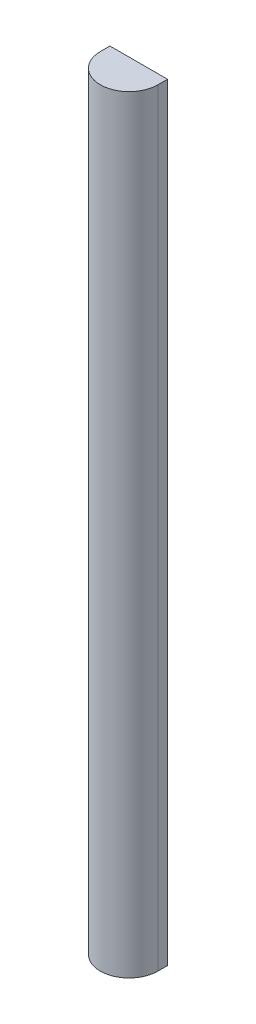
ISO-10303-21;
HEADER;
FILE_DESCRIPTION(('STEP AP214'),'2;1');
FILE_NAME('part.step','',(''),(''),'','','');
FILE_SCHEMA(('AUTOMOTIVE_DESIGN { 1 0 10303 214 1 1 1 1 }'));
ENDSEC;
DATA;
#1=APPLICATION_CONTEXT('core data for automotive mechanical design processes');
#2=APPLICATION_PROTOCOL_DEFINITION('international standard','automotive_design',2000,#1);
#3=PRODUCT_CONTEXT('',#1,'mechanical');
#4=PRODUCT('Part','Part','',(#3));
#5=PRODUCT_RELATED_PRODUCT_CATEGORY('part','',(#4));
#6=PRODUCT_DEFINITION_FORMATION('','',#4);
#7=PRODUCT_DEFINITION_CONTEXT('part definition',#1,'design');
#8=PRODUCT_DEFINITION('design','',#6,#7);
#9=PRODUCT_DEFINITION_SHAPE('','',#8);
#10=(LENGTH_UNIT() NAMED_UNIT(*) SI_UNIT(.MILLI.,.METRE.));
#11=(NAMED_UNIT(*) PLANE_ANGLE_UNIT() SI_UNIT($,.RADIAN.));
#12=(NAMED_UNIT(*) SI_UNIT($,.STERADIAN.) SOLID_ANGLE_UNIT());
#13=UNCERTAINTY_MEASURE_WITH_UNIT(LENGTH_MEASURE(1.E-05),#10,'distance_accuracy_value','');
#14=(GEOMETRIC_REPRESENTATION_CONTEXT(3) GLOBAL_UNCERTAINTY_ASSIGNED_CONTEXT((#13)) GLOBAL_UNIT_ASSIGNED_CONTEXT((#10,
#11,#12)) REPRESENTATION_CONTEXT('',''));
#15=CARTESIAN_POINT('',(0.,0.,0.));
#16=DIRECTION('',(0.,0.,1.));
#17=DIRECTION('',(1.,0.,0.));
#18=AXIS2_PLACEMENT_3D('',#15,#16,#17);
#19=CARTESIAN_POINT('',(0.,1000.,25.));
#20=DIRECTION('',(0.,1.,0.));
#21=DIRECTION('',(0.,0.,1.));
#22=AXIS2_PLACEMENT_3D('',#19,#20,#21);
#23=CYLINDRICAL_SURFACE('',#22,75.);
#24=DIRECTION('',(0.,1.,0.));
#25=VECTOR('',#24,1.);
#26=CARTESIAN_POINT('',(75.,-1000.,25.));
#27=LINE('',#26,#25);
#28=CARTESIAN_POINT('',(75.,1000.,25.));
#29=VERTEX_POINT('',#28);
#30=CARTESIAN_POINT('',(75.,-1000.,25.));
#31=VERTEX_POINT('',#30);
#32=EDGE_CURVE('E90',#29,#31,#27,.F.);
#33=ORIENTED_EDGE('',*,*,#32,.F.);
#34=CARTESIAN_POINT('',(0.,1000.,25.));
#35=DIRECTION('',(0.,-1.,0.));
#36=DIRECTION('',(0.,0.,-1.));
#37=AXIS2_PLACEMENT_3D('',#34,#35,#36);
#38=CIRCLE('',#37,75.);
#39=CARTESIAN_POINT('',(-75.,1000.,25.));
#40=VERTEX_POINT('',#39);
#41=EDGE_CURVE('E50',#40,#29,#38,.F.);
#42=ORIENTED_EDGE('',*,*,#41,.F.);
#43=DIRECTION('',(0.,1.,0.));
#44=VECTOR('',#43,1.);
#45=CARTESIAN_POINT('',(-75.,-1000.,25.));
#46=LINE('',#45,#44);
#47=CARTESIAN_POINT('',(-75.,-1000.,25.));
#48=VERTEX_POINT('',#47);
#49=EDGE_CURVE('E122',#48,#40,#46,.T.);
#50=ORIENTED_EDGE('',*,*,#49,.F.);
#51=CARTESIAN_POINT('',(0.,-1000.,25.));
#52=DIRECTION('',(0.,1.,0.));
#53=DIRECTION('',(0.,0.,1.));
#54=AXIS2_PLACEMENT_3D('',#51,#52,#53);
#55=CIRCLE('',#54,75.);
#56=EDGE_CURVE('E11',#31,#48,#55,.F.);
#57=ORIENTED_EDGE('',*,*,#56,.F.);
#58=EDGE_LOOP('',(#33,#42,#50,#57));
#59=FACE_BOUND('',#58,.T.);
#60=ADVANCED_FACE('F41',(#59),#23,.T.);
#61=CARTESIAN_POINT('',(75.,-1000.,100.));
#62=DIRECTION('',(-1.,0.,0.));
#63=DIRECTION('',(0.,0.,1.));
#64=AXIS2_PLACEMENT_3D('',#61,#62,#63);
#65=PLANE('',#64);
#66=DIRECTION('',(0.,0.,-1.));
#67=VECTOR('',#66,1.);
#68=CARTESIAN_POINT('',(75.,1000.,100.));
#69=LINE('',#68,#67);
#70=CARTESIAN_POINT('',(75.,1000.,0.));
#71=VERTEX_POINT('',#70);
#72=EDGE_CURVE('E80',#29,#71,#69,.T.);
#73=ORIENTED_EDGE('',*,*,#72,.F.);
#74=ORIENTED_EDGE('',*,*,#32,.T.);
#75=DIRECTION('',(0.,0.,-1.));
#76=VECTOR('',#75,1.);
#77=CARTESIAN_POINT('',(75.,-1000.,100.));
#78=LINE('',#77,#76);
#79=CARTESIAN_POINT('',(75.,-1000.,0.));
#80=VERTEX_POINT('',#79);
#81=EDGE_CURVE('E103',#31,#80,#78,.T.);
#82=ORIENTED_EDGE('',*,*,#81,.T.);
#83=DIRECTION('',(0.,1.,0.));
#84=VECTOR('',#83,1.);
#85=CARTESIAN_POINT('',(75.,-1000.,0.));
#86=LINE('',#85,#84);
#87=EDGE_CURVE('E97',#80,#71,#86,.T.);
#88=ORIENTED_EDGE('',*,*,#87,.T.);
#89=EDGE_LOOP('',(#73,#74,#82,#88));
#90=FACE_BOUND('',#89,.T.);
#91=ADVANCED_FACE('F102',(#90),#65,.F.);
#92=CARTESIAN_POINT('',(-75.,1000.,100.));
#93=DIRECTION('',(0.,-1.,0.));
#94=DIRECTION('',(0.,0.,-1.));
#95=AXIS2_PLACEMENT_3D('',#92,#93,#94);
#96=PLANE('',#95);
#97=DIRECTION('',(0.,0.,-1.));
#98=VECTOR('',#97,1.);
#99=CARTESIAN_POINT('',(-75.,1000.,100.));
#100=LINE('',#99,#98);
#101=CARTESIAN_POINT('',(-75.,1000.,0.));
#102=VERTEX_POINT('',#101);
#103=EDGE_CURVE('E91',#40,#102,#100,.T.);
#104=ORIENTED_EDGE('',*,*,#103,.F.);
#105=ORIENTED_EDGE('',*,*,#41,.T.);
#106=ORIENTED_EDGE('',*,*,#72,.T.);
#107=DIRECTION('',(-1.,0.,0.));
#108=VECTOR('',#107,1.);
#109=CARTESIAN_POINT('',(-75.,1000.,0.));
#110=LINE('',#109,#108);
#111=EDGE_CURVE('E84',#71,#102,#110,.T.);
#112=ORIENTED_EDGE('',*,*,#111,.T.);
#113=EDGE_LOOP('',(#104,#105,#106,#112));
#114=FACE_BOUND('',#113,.T.);
#115=ADVANCED_FACE('F83',(#114),#96,.F.);
#116=CARTESIAN_POINT('',(-75.,-1000.,100.));
#117=DIRECTION('',(1.,0.,0.));
#118=DIRECTION('',(0.,0.,-1.));
#119=AXIS2_PLACEMENT_3D('',#116,#117,#118);
#120=PLANE('',#119);
#121=DIRECTION('',(0.,0.,-1.));
#122=VECTOR('',#121,1.);
#123=CARTESIAN_POINT('',(-75.,-1000.,100.));
#124=LINE('',#123,#122);
#125=CARTESIAN_POINT('',(-75.,-1000.,0.));
#126=VERTEX_POINT('',#125);
#127=EDGE_CURVE('E115',#48,#126,#124,.T.);
#128=ORIENTED_EDGE('',*,*,#127,.F.);
#129=ORIENTED_EDGE('',*,*,#49,.T.);
#130=ORIENTED_EDGE('',*,*,#103,.T.);
#131=DIRECTION('',(0.,-1.,0.));
#132=VECTOR('',#131,1.);
#133=CARTESIAN_POINT('',(-75.,-1000.,0.));
#134=LINE('',#133,#132);
#135=EDGE_CURVE('E99',#102,#126,#134,.T.);
#136=ORIENTED_EDGE('',*,*,#135,.T.);
#137=EDGE_LOOP('',(#128,#129,#130,#136));
#138=FACE_BOUND('',#137,.T.);
#139=ADVANCED_FACE('F127',(#138),#120,.F.);
#140=CARTESIAN_POINT('',(-75.,-1000.,100.));
#141=DIRECTION('',(0.,1.,0.));
#142=DIRECTION('',(0.,0.,1.));
#143=AXIS2_PLACEMENT_3D('',#140,#141,#142);
#144=PLANE('',#143);
#145=ORIENTED_EDGE('',*,*,#81,.F.);
#146=ORIENTED_EDGE('',*,*,#56,.T.);
#147=ORIENTED_EDGE('',*,*,#127,.T.);
#148=DIRECTION('',(1.,0.,0.));
#149=VECTOR('',#148,1.);
#150=CARTESIAN_POINT('',(-75.,-1000.,0.));
#151=LINE('',#150,#149);
#152=EDGE_CURVE('E110',#126,#80,#151,.T.);
#153=ORIENTED_EDGE('',*,*,#152,.T.);
#154=EDGE_LOOP('',(#145,#146,#147,#153));
#155=FACE_BOUND('',#154,.T.);
#156=ADVANCED_FACE('F128',(#155),#144,.F.);
#157=CARTESIAN_POINT('',(0.,0.,0.));
#158=DIRECTION('',(0.,0.,-1.));
#159=DIRECTION('',(-1.,0.,0.));
#160=AXIS2_PLACEMENT_3D('',#157,#158,#159);
#161=PLANE('',#160);
#162=ORIENTED_EDGE('',*,*,#87,.F.);
#163=ORIENTED_EDGE('',*,*,#152,.F.);
#164=ORIENTED_EDGE('',*,*,#135,.F.);
#165=ORIENTED_EDGE('',*,*,#111,.F.);
#166=EDGE_LOOP('',(#162,#163,#164,#165));
#167=FACE_BOUND('',#166,.T.);
#168=ADVANCED_FACE('F95',(#167),#161,.T.);
#169=CLOSED_SHELL('',(#60,#91,#115,#139,#156,#168));
#170=MANIFOLD_SOLID_BREP('B2',#169);
#171=ADVANCED_BREP_SHAPE_REPRESENTATION('',(#18,#170),#14);
#172=SHAPE_DEFINITION_REPRESENTATION(#9,#171);
ENDSEC;
END-ISO-10303-21;
